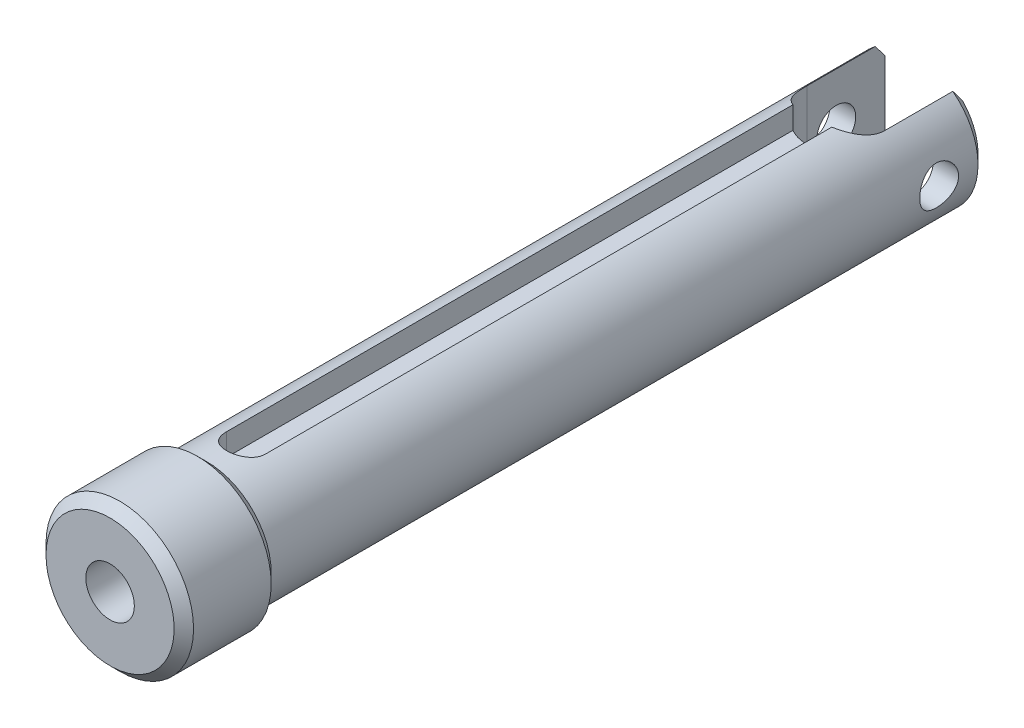
ISO-10303-21;
HEADER;
FILE_DESCRIPTION(('STEP AP214'),'2;1');
FILE_NAME('part.step','',(''),(''),'','','');
FILE_SCHEMA(('AUTOMOTIVE_DESIGN { 1 0 10303 214 1 1 1 1 }'));
ENDSEC;
DATA;
#1=APPLICATION_CONTEXT('core data for automotive mechanical design processes');
#2=APPLICATION_PROTOCOL_DEFINITION('international standard','automotive_design',2000,#1);
#3=PRODUCT_CONTEXT('',#1,'mechanical');
#4=PRODUCT('Part','Part','',(#3));
#5=PRODUCT_RELATED_PRODUCT_CATEGORY('part','',(#4));
#6=PRODUCT_DEFINITION_FORMATION('','',#4);
#7=PRODUCT_DEFINITION_CONTEXT('part definition',#1,'design');
#8=PRODUCT_DEFINITION('design','',#6,#7);
#9=PRODUCT_DEFINITION_SHAPE('','',#8);
#10=(LENGTH_UNIT() NAMED_UNIT(*) SI_UNIT(.MILLI.,.METRE.));
#11=(NAMED_UNIT(*) PLANE_ANGLE_UNIT() SI_UNIT($,.RADIAN.));
#12=(NAMED_UNIT(*) SI_UNIT($,.STERADIAN.) SOLID_ANGLE_UNIT());
#13=UNCERTAINTY_MEASURE_WITH_UNIT(LENGTH_MEASURE(1.E-05),#10,'distance_accuracy_value','');
#14=(GEOMETRIC_REPRESENTATION_CONTEXT(3) GLOBAL_UNCERTAINTY_ASSIGNED_CONTEXT((#13)) GLOBAL_UNIT_ASSIGNED_CONTEXT((#10,
#11,#12)) REPRESENTATION_CONTEXT('',''));
#15=CARTESIAN_POINT('',(0.,0.,0.));
#16=DIRECTION('',(0.,0.,1.));
#17=DIRECTION('',(1.,0.,0.));
#18=AXIS2_PLACEMENT_3D('',#15,#16,#17);
#19=CARTESIAN_POINT('',(0.,0.,-31.0000000000002));
#20=DIRECTION('',(0.,0.,1.));
#21=DIRECTION('',(0.,-1.,0.));
#22=AXIS2_PLACEMENT_3D('',#19,#20,#21);
#23=CONICAL_SURFACE('',#22,1.2499999999993,0.942477796076442);
#24=CARTESIAN_POINT('',(-2.22044604925031E-13,0.,-31.9081781600068));
#25=VERTEX_POINT('',#24);
#26=VERTEX_LOOP('',#25);
#27=FACE_BOUND('',#26,.T.);
#28=CARTESIAN_POINT('',(0.,0.,-31.));
#29=DIRECTION('',(0.,0.,1.));
#30=DIRECTION('',(1.,0.,0.));
#31=AXIS2_PLACEMENT_3D('',#28,#29,#30);
#32=CIRCLE('',#31,1.25);
#33=CARTESIAN_POINT('',(1.25,0.,-31.));
#34=VERTEX_POINT('',#33);
#35=EDGE_CURVE('E276',#34,#34,#32,.T.);
#36=ORIENTED_EDGE('',*,*,#35,.T.);
#37=EDGE_LOOP('',(#36));
#38=FACE_BOUND('',#37,.T.);
#39=ADVANCED_FACE('F39',(#27,#38),#23,.F.);
#40=CARTESIAN_POINT('',(0.,0.,0.));
#41=DIRECTION('',(0.,0.,1.));
#42=DIRECTION('',(1.,0.,0.));
#43=AXIS2_PLACEMENT_3D('',#40,#41,#42);
#44=CYLINDRICAL_SURFACE('',#43,1.25);
#45=CARTESIAN_POINT('',(0.,0.,0.));
#46=DIRECTION('',(0.,0.,1.));
#47=DIRECTION('',(1.,0.,0.));
#48=AXIS2_PLACEMENT_3D('',#45,#46,#47);
#49=CIRCLE('',#48,1.25);
#50=CARTESIAN_POINT('',(1.25,0.,0.));
#51=VERTEX_POINT('',#50);
#52=EDGE_CURVE('E272',#51,#51,#49,.F.);
#53=ORIENTED_EDGE('',*,*,#52,.F.);
#54=EDGE_LOOP('',(#53));
#55=FACE_BOUND('',#54,.T.);
#56=ORIENTED_EDGE('',*,*,#35,.F.);
#57=EDGE_LOOP('',(#56));
#58=FACE_BOUND('',#57,.T.);
#59=ADVANCED_FACE('F349',(#55,#58),#44,.F.);
#60=CARTESIAN_POINT('',(1.25,0.,0.));
#61=DIRECTION('',(0.,0.,1.));
#62=DIRECTION('',(1.,0.,0.));
#63=AXIS2_PLACEMENT_3D('',#60,#61,#62);
#64=PLANE('',#63);
#65=ORIENTED_EDGE('',*,*,#52,.T.);
#66=EDGE_LOOP('',(#65));
#67=FACE_BOUND('',#66,.T.);
#68=CARTESIAN_POINT('',(0.,0.,0.));
#69=DIRECTION('',(0.,0.,-1.));
#70=DIRECTION('',(-1.,0.,0.));
#71=AXIS2_PLACEMENT_3D('',#68,#69,#70);
#72=CIRCLE('',#71,3.30000000002428);
#73=CARTESIAN_POINT('',(-3.30000000002428,0.,0.));
#74=VERTEX_POINT('',#73);
#75=EDGE_CURVE('E268',#74,#74,#72,.T.);
#76=ORIENTED_EDGE('',*,*,#75,.F.);
#77=EDGE_LOOP('',(#76));
#78=FACE_BOUND('',#77,.T.);
#79=ADVANCED_FACE('F343',(#67,#78),#64,.T.);
#80=CARTESIAN_POINT('',(0.,0.,-0.50000000004502));
#81=DIRECTION('',(0.,0.,-1.));
#82=DIRECTION('',(-1.,0.,0.));
#83=AXIS2_PLACEMENT_3D('',#80,#81,#82);
#84=CONICAL_SURFACE('',#83,3.80000000012615,0.785398163454292);
#85=ORIENTED_EDGE('',*,*,#75,.T.);
#86=EDGE_LOOP('',(#85));
#87=FACE_BOUND('',#86,.T.);
#88=CARTESIAN_POINT('',(0.,0.,-0.500000000000001));
#89=DIRECTION('',(0.,0.,1.));
#90=DIRECTION('',(1.,0.,0.));
#91=AXIS2_PLACEMENT_3D('',#88,#89,#90);
#92=CIRCLE('',#91,3.8);
#93=CARTESIAN_POINT('',(3.8,0.,-0.500000000000001));
#94=VERTEX_POINT('',#93);
#95=EDGE_CURVE('E176',#94,#94,#92,.F.);
#96=ORIENTED_EDGE('',*,*,#95,.F.);
#97=EDGE_LOOP('',(#96));
#98=FACE_BOUND('',#97,.T.);
#99=ADVANCED_FACE('F336',(#87,#98),#84,.T.);
#100=CARTESIAN_POINT('',(0.,2.,-7.));
#101=DIRECTION('',(0.,1.,0.));
#102=DIRECTION('',(0.,0.,1.));
#103=AXIS2_PLACEMENT_3D('',#100,#101,#102);
#104=PLANE('',#103);
#105=DIRECTION('',(0.,0.,1.));
#106=VECTOR('',#105,1.);
#107=CARTESIAN_POINT('',(1.,2.,-7.));
#108=LINE('',#107,#106);
#109=CARTESIAN_POINT('',(1.,2.,-36.1761273524378));
#110=VERTEX_POINT('',#109);
#111=CARTESIAN_POINT('',(1.,2.,-7.));
#112=VERTEX_POINT('',#111);
#113=EDGE_CURVE('E141',#110,#112,#108,.T.);
#114=ORIENTED_EDGE('',*,*,#113,.F.);
#115=CARTESIAN_POINT('',(0.,2.,-37.9081781600067));
#116=DIRECTION('',(0.,1.,0.));
#117=DIRECTION('',(0.,0.,1.));
#118=AXIS2_PLACEMENT_3D('',#115,#116,#117);
#119=CIRCLE('',#118,2.);
#120=CARTESIAN_POINT('',(-1.,2.,-36.1761273524378));
#121=VERTEX_POINT('',#120);
#122=EDGE_CURVE('E181',#110,#121,#119,.F.);
#123=ORIENTED_EDGE('',*,*,#122,.T.);
#124=DIRECTION('',(0.,0.,-1.));
#125=VECTOR('',#124,1.);
#126=CARTESIAN_POINT('',(-1.,2.,-7.));
#127=LINE('',#126,#125);
#128=CARTESIAN_POINT('',(-1.,2.,-7.));
#129=VERTEX_POINT('',#128);
#130=EDGE_CURVE('E169',#129,#121,#127,.T.);
#131=ORIENTED_EDGE('',*,*,#130,.F.);
#132=CARTESIAN_POINT('',(0.,2.,-7.));
#133=DIRECTION('',(0.,-1.,0.));
#134=DIRECTION('',(0.,0.,-1.));
#135=AXIS2_PLACEMENT_3D('',#132,#133,#134);
#136=CIRCLE('',#135,1.);
#137=EDGE_CURVE('E144',#129,#112,#136,.F.);
#138=ORIENTED_EDGE('',*,*,#137,.T.);
#139=EDGE_LOOP('',(#114,#123,#131,#138));
#140=FACE_BOUND('',#139,.T.);
#141=ADVANCED_FACE('F333',(#140),#104,.T.);
#142=CARTESIAN_POINT('',(3.3,0.,-41.9081781600067));
#143=DIRECTION('',(0.,0.,-1.));
#144=DIRECTION('',(-1.,0.,0.));
#145=AXIS2_PLACEMENT_3D('',#142,#143,#144);
#146=PLANE('',#145);
#147=DIRECTION('',(0.,1.,0.));
#148=VECTOR('',#147,1.);
#149=CARTESIAN_POINT('',(-2.,-3.8,-41.9081781600067));
#150=LINE('',#149,#148);
#151=CARTESIAN_POINT('',(-2.,1.9595917941417,-41.9081781599484));
#152=VERTEX_POINT('',#151);
#153=CARTESIAN_POINT('',(-2.,-1.95959179408702,-41.9081781599867));
#154=VERTEX_POINT('',#153);
#155=EDGE_CURVE('E281',#152,#154,#150,.F.);
#156=ORIENTED_EDGE('',*,*,#155,.T.);
#157=CARTESIAN_POINT('',(0.,0.,-41.9081781599666));
#158=DIRECTION('',(0.,0.,1.));
#159=DIRECTION('',(1.,0.,0.));
#160=AXIS2_PLACEMENT_3D('',#157,#158,#159);
#161=CIRCLE('',#160,2.79999999992242);
#162=EDGE_CURVE('E179',#152,#154,#161,.T.);
#163=ORIENTED_EDGE('',*,*,#162,.F.);
#164=EDGE_LOOP('',(#156,#163));
#165=FACE_BOUND('',#164,.T.);
#166=ADVANCED_FACE('F335',(#165),#146,.T.);
#167=CARTESIAN_POINT('',(3.3,0.,-41.9081781600067));
#168=DIRECTION('',(0.,0.,-1.));
#169=DIRECTION('',(-1.,0.,0.));
#170=AXIS2_PLACEMENT_3D('',#167,#168,#169);
#171=PLANE('',#170);
#172=DIRECTION('',(0.,1.,0.));
#173=VECTOR('',#172,1.);
#174=CARTESIAN_POINT('',(2.,-3.8,-41.9081781600067));
#175=LINE('',#174,#173);
#176=CARTESIAN_POINT('',(2.,-1.95959179408703,-41.9081781599867));
#177=VERTEX_POINT('',#176);
#178=CARTESIAN_POINT('',(2.,1.95959179408703,-41.9081781599867));
#179=VERTEX_POINT('',#178);
#180=EDGE_CURVE('E263',#177,#179,#175,.T.);
#181=ORIENTED_EDGE('',*,*,#180,.T.);
#182=CARTESIAN_POINT('',(0.,0.,-41.9081781599666));
#183=DIRECTION('',(0.,0.,1.));
#184=DIRECTION('',(1.,0.,0.));
#185=AXIS2_PLACEMENT_3D('',#182,#183,#184);
#186=CIRCLE('',#185,2.79999999992242);
#187=EDGE_CURVE('E319',#177,#179,#186,.T.);
#188=ORIENTED_EDGE('',*,*,#187,.F.);
#189=EDGE_LOOP('',(#181,#188));
#190=FACE_BOUND('',#189,.T.);
#191=ADVANCED_FACE('F41',(#190),#171,.T.);
#192=CARTESIAN_POINT('',(0.,0.,0.));
#193=DIRECTION('',(0.,0.,1.));
#194=DIRECTION('',(1.,0.,0.));
#195=AXIS2_PLACEMENT_3D('',#192,#193,#194);
#196=CYLINDRICAL_SURFACE('',#195,3.8);
#197=CARTESIAN_POINT('',(0.,0.,-4.50000000000728));
#198=DIRECTION('',(0.,0.,1.));
#199=DIRECTION('',(1.,0.,0.));
#200=AXIS2_PLACEMENT_3D('',#197,#198,#199);
#201=CIRCLE('',#200,3.80000000001246);
#202=CARTESIAN_POINT('',(3.80000000001246,0.,-4.50000000000728));
#203=VERTEX_POINT('',#202);
#204=EDGE_CURVE('E171',#203,#203,#201,.F.);
#205=ORIENTED_EDGE('',*,*,#204,.F.);
#206=EDGE_LOOP('',(#205));
#207=FACE_BOUND('',#206,.T.);
#208=ORIENTED_EDGE('',*,*,#95,.T.);
#209=EDGE_LOOP('',(#208));
#210=FACE_BOUND('',#209,.T.);
#211=ADVANCED_FACE('F346',(#207,#210),#196,.T.);
#212=CARTESIAN_POINT('',(1.,12.,-7.));
#213=DIRECTION('',(-1.,0.,0.));
#214=DIRECTION('',(0.,0.,1.));
#215=AXIS2_PLACEMENT_3D('',#212,#213,#214);
#216=PLANE('',#215);
#217=DIRECTION('',(0.,-1.,0.));
#218=VECTOR('',#217,1.);
#219=CARTESIAN_POINT('',(1.,12.,-7.));
#220=LINE('',#219,#218);
#221=CARTESIAN_POINT('',(1.,3.14483703870328,-7.));
#222=VERTEX_POINT('',#221);
#223=EDGE_CURVE('E133',#112,#222,#220,.F.);
#224=ORIENTED_EDGE('',*,*,#223,.T.);
#225=DIRECTION('',(0.,0.,1.));
#226=VECTOR('',#225,1.);
#227=CARTESIAN_POINT('',(0.999999999999997,3.14483703870328,0.));
#228=LINE('',#227,#226);
#229=CARTESIAN_POINT('',(1.,3.14483703870328,-36.1761273524378));
#230=VERTEX_POINT('',#229);
#231=EDGE_CURVE('E138',#230,#222,#228,.T.);
#232=ORIENTED_EDGE('',*,*,#231,.F.);
#233=DIRECTION('',(0.,1.,0.));
#234=VECTOR('',#233,1.);
#235=CARTESIAN_POINT('',(1.,-3.8,-36.1761273524378));
#236=LINE('',#235,#234);
#237=EDGE_CURVE('E264',#230,#110,#236,.F.);
#238=ORIENTED_EDGE('',*,*,#237,.T.);
#239=ORIENTED_EDGE('',*,*,#113,.T.);
#240=EDGE_LOOP('',(#224,#232,#238,#239));
#241=FACE_BOUND('',#240,.T.);
#242=ADVANCED_FACE('F135',(#241),#216,.T.);
#243=CARTESIAN_POINT('',(0.,12.,-7.));
#244=DIRECTION('',(0.,-1.,0.));
#245=DIRECTION('',(0.,0.,-1.));
#246=AXIS2_PLACEMENT_3D('',#243,#244,#245);
#247=CYLINDRICAL_SURFACE('',#246,1.);
#248=ORIENTED_EDGE('',*,*,#137,.F.);
#249=DIRECTION('',(0.,1.,0.));
#250=VECTOR('',#249,1.);
#251=CARTESIAN_POINT('',(-1.,12.,-7.));
#252=LINE('',#251,#250);
#253=CARTESIAN_POINT('',(-1.,3.14483703870327,-7.));
#254=VERTEX_POINT('',#253);
#255=EDGE_CURVE('E143',#254,#129,#252,.F.);
#256=ORIENTED_EDGE('',*,*,#255,.F.);
#257=CARTESIAN_POINT('',(1.,3.14483703870327,-7.));
#258=CARTESIAN_POINT('',(1.00000058446485,3.14483466319056,-6.97256109089109));
#259=CARTESIAN_POINT('',(0.998869935383343,3.14519660366548,-6.94513601880278));
#260=CARTESIAN_POINT('',(0.994364372490053,3.14662483342331,-6.89049551172468));
#261=CARTESIAN_POINT('',(0.990989971874482,3.14769096164235,-6.8632800302364));
#262=CARTESIAN_POINT('',(0.977558579012706,3.15189978520597,-6.78238818203788));
#263=CARTESIAN_POINT('',(0.964193099721557,3.1560532526192,-6.72927493985201));
#264=CARTESIAN_POINT('',(0.929101879648924,3.16655966647781,-6.62618327140285));
#265=CARTESIAN_POINT('',(0.907379209601419,3.17291180496607,-6.57620370155038));
#266=CARTESIAN_POINT('',(0.856227318830381,3.18709542858823,-6.48056143224296));
#267=CARTESIAN_POINT('',(0.82679441203035,3.19492762079944,-6.43490081182208));
#268=CARTESIAN_POINT('',(0.760050107473455,3.21146959337391,-6.34775495832486));
#269=CARTESIAN_POINT('',(0.722534508354982,3.22019826968664,-6.30642974127771));
#270=CARTESIAN_POINT('',(0.641124678022101,3.237389021534,-6.23054817290801));
#271=CARTESIAN_POINT('',(0.597229366735894,3.24585105163024,-6.19599297006512));
#272=CARTESIAN_POINT('',(0.503159555901947,3.26177102246715,-6.13393351088603));
#273=CARTESIAN_POINT('',(0.452871926360489,3.26920395361822,-6.10659376340788));
#274=CARTESIAN_POINT('',(0.348151281826175,3.28200676071688,-6.06082286305101));
#275=CARTESIAN_POINT('',(0.29371935706494,3.28737717701464,-6.04238937652894));
#276=CARTESIAN_POINT('',(0.183936750095662,3.29531583832292,-6.01548615853358));
#277=CARTESIAN_POINT('',(0.128659057368611,3.29796117629446,-6.00674174325955));
#278=CARTESIAN_POINT('',(0.0173609280514114,3.30042333545331,-5.998595838082));
#279=CARTESIAN_POINT('',(-0.0386593626860392,3.30024070408913,-5.99919253989158));
#280=CARTESIAN_POINT('',(-0.147921762483602,3.29712168803216,-6.00952880677701));
#281=CARTESIAN_POINT('',(-0.201194998209486,3.29427497016586,-6.0189706750913));
#282=CARTESIAN_POINT('',(-0.305361228362162,3.28625698323866,-6.04624231094544));
#283=CARTESIAN_POINT('',(-0.356254097082038,3.28108559156468,-6.06407252092406));
#284=CARTESIAN_POINT('',(-0.45491871979671,3.26887616846965,-6.10781394900735));
#285=CARTESIAN_POINT('',(-0.502646534164445,3.26181682101702,-6.13381808312765));
#286=CARTESIAN_POINT('',(-0.59315506276725,3.24657920737532,-6.19309529006151));
#287=CARTESIAN_POINT('',(-0.635934643024798,3.23840068564096,-6.22637002403718));
#288=CARTESIAN_POINT('',(-0.717105293590922,3.22142018042105,-6.30077988504639));
#289=CARTESIAN_POINT('',(-0.755258554122722,3.2126063247781,-6.34217203761805));
#290=CARTESIAN_POINT('',(-0.824157753357584,3.19562620313545,-6.43086254822946));
#291=CARTESIAN_POINT('',(-0.854901515300654,3.18746012791199,-6.47816263571923));
#292=CARTESIAN_POINT('',(-0.908367901499331,3.17264058733765,-6.57797226116264));
#293=CARTESIAN_POINT('',(-0.931003162469822,3.16600385648028,-6.63053116273699));
#294=CARTESIAN_POINT('',(-0.96700287373763,3.15519643045607,-6.73893484407036));
#295=CARTESIAN_POINT('',(-0.980381536827423,3.15102195614449,-6.79477444289047));
#296=CARTESIAN_POINT('',(-0.992589206484928,3.14718577754826,-6.87594846249085));
#297=CARTESIAN_POINT('',(-0.995367858450242,3.14630699315726,-6.90068681113467));
#298=CARTESIAN_POINT('',(-0.999071633157644,3.14513251759889,-6.95027923689093));
#299=CARTESIAN_POINT('',(-0.999999456846607,3.14483597676302,-6.97513309223449));
#300=CARTESIAN_POINT('',(-1.,3.14483703870327,-7.));
#301=B_SPLINE_CURVE_WITH_KNOTS('',3,(#257,#258,#259,#260,#261,#262,#263,#264,#265,#266,#267,
#268,#269,#270,#271,#272,#273,#274,#275,#276,#277,#278,#279,#280,#281,#282,#283,#284,#285,#286,
#287,#288,#289,#290,#291,#292,#293,#294,#295,#296,#297,#298,#299,#300),.UNSPECIFIED.,.F.,.F.,(4,
2,2,2,2,2,2,2,2,2,2,2,2,2,2,2,2,2,2,2,2,4),(0.,0.0822639668022753,0.164509124462838,
0.328432621976645,0.492295945508559,0.656237751530239,0.824946577892225,0.993683999644774,
1.16598871173084,1.33824825153758,1.50548829210002,1.6726959581369,1.83447076928378,
1.99625411411647,2.15994740632491,2.3236781378043,2.49382803113785,2.66402785028373,
2.83600989360371,3.0077272822234,3.08239220960877,3.15694809718305),.UNSPECIFIED.);
#302=EDGE_CURVE('E147',#222,#254,#301,.T.);
#303=ORIENTED_EDGE('',*,*,#302,.F.);
#304=ORIENTED_EDGE('',*,*,#223,.F.);
#305=EDGE_LOOP('',(#248,#256,#303,#304));
#306=FACE_BOUND('',#305,.T.);
#307=ADVANCED_FACE('F148',(#306),#247,.F.);
#308=CARTESIAN_POINT('',(-1.,12.,-7.));
#309=DIRECTION('',(1.,0.,0.));
#310=DIRECTION('',(0.,0.,-1.));
#311=AXIS2_PLACEMENT_3D('',#308,#309,#310);
#312=PLANE('',#311);
#313=ORIENTED_EDGE('',*,*,#255,.T.);
#314=ORIENTED_EDGE('',*,*,#130,.T.);
#315=DIRECTION('',(0.,1.,0.));
#316=VECTOR('',#315,1.);
#317=CARTESIAN_POINT('',(-1.,-3.8,-36.1761273524378));
#318=LINE('',#317,#316);
#319=CARTESIAN_POINT('',(-0.999999999999997,3.14483703870327,-36.1761273524378));
#320=VERTEX_POINT('',#319);
#321=EDGE_CURVE('E227',#121,#320,#318,.T.);
#322=ORIENTED_EDGE('',*,*,#321,.T.);
#323=DIRECTION('',(0.,0.,1.));
#324=VECTOR('',#323,1.);
#325=CARTESIAN_POINT('',(-1.,3.14483703870327,0.));
#326=LINE('',#325,#324);
#327=EDGE_CURVE('E153',#254,#320,#326,.F.);
#328=ORIENTED_EDGE('',*,*,#327,.F.);
#329=EDGE_LOOP('',(#313,#314,#322,#328));
#330=FACE_BOUND('',#329,.T.);
#331=ADVANCED_FACE('F302',(#330),#312,.T.);
#332=CARTESIAN_POINT('',(0.,0.,-41.4081781600353));
#333=DIRECTION('',(0.,0.,1.));
#334=DIRECTION('',(1.,0.,0.));
#335=AXIS2_PLACEMENT_3D('',#332,#333,#334);
#336=CONICAL_SURFACE('',#335,3.29999999985375,0.785398163397448);
#337=CARTESIAN_POINT('',(-2.00000000002675,2.62488094963453,-41.4081781599479));
#338=CARTESIAN_POINT('',(-2.00000000000966,2.5705897477742,-41.4513571675065));
#339=CARTESIAN_POINT('',(-2.0000000000026,2.51606255803639,-41.4942421574162));
#340=CARTESIAN_POINT('',(-1.9999999999974,2.40647248083344,-41.5792952953835));
#341=CARTESIAN_POINT('',(-1.99999999999926,2.35140971987974,-41.6214636065639));
#342=CARTESIAN_POINT('',(-2.00000000000074,2.24065670022885,-41.7049769497188));
#343=CARTESIAN_POINT('',(-2.00000000000037,2.18496640664413,-41.7463219355635));
#344=CARTESIAN_POINT('',(-1.99999999999963,2.07285129425181,-41.8280303119863));
#345=CARTESIAN_POINT('',(-1.99999999999926,2.01642630858367,-41.8683934733883));
#346=CARTESIAN_POINT('',(-2.,1.95959179416729,-41.9081781599305));
#347=B_SPLINE_CURVE_WITH_KNOTS('',3,(#337,#338,#339,#340,#341,#342,#343,#344,#345,#346),
.UNSPECIFIED.,.F.,.F.,(4,2,2,2,4),(0.,0.208106269114682,0.416164519243032,0.624234393958115,
0.832352378876906),.UNSPECIFIED.);
#348=CARTESIAN_POINT('',(-2.,2.62488094965267,-41.4081781599707));
#349=VERTEX_POINT('',#348);
#350=EDGE_CURVE('E283',#349,#152,#347,.T.);
#351=ORIENTED_EDGE('',*,*,#350,.T.);
#352=ORIENTED_EDGE('',*,*,#162,.T.);
#353=CARTESIAN_POINT('',(-2.00000000001522,-1.95959179417273,-41.9081781599373));
#354=CARTESIAN_POINT('',(-2.0000000000055,-2.01642630858618,-41.8683934733909));
#355=CARTESIAN_POINT('',(-2.00000000000148,-2.07285129425285,-41.8280303119869));
#356=CARTESIAN_POINT('',(-1.99999999999852,-2.1849664066439,-41.7463219355623));
#357=CARTESIAN_POINT('',(-1.99999999999958,-2.24065670022884,-41.7049769497179));
#358=CARTESIAN_POINT('',(-2.00000000000042,-2.35140971988068,-41.6214636065641));
#359=CARTESIAN_POINT('',(-2.00000000000021,-2.40647248083511,-41.5792952953845));
#360=CARTESIAN_POINT('',(-1.99999999999979,-2.51606255803605,-41.4942421574142));
#361=CARTESIAN_POINT('',(-1.99999999999958,-2.57058974777112,-41.4513571675009));
#362=CARTESIAN_POINT('',(-2.,-2.62488094962501,-41.4081781599338));
#363=B_SPLINE_CURVE_WITH_KNOTS('',3,(#353,#354,#355,#356,#357,#358,#359,#360,#361,#362),
.UNSPECIFIED.,.F.,.F.,(4,2,2,2,4),(0.,0.20811798491885,0.41618785963396,0.624246109762607,
0.832352378877637),.UNSPECIFIED.);
#364=CARTESIAN_POINT('',(-1.99999999999991,-2.62488094965283,-41.4081781599706));
#365=VERTEX_POINT('',#364);
#366=EDGE_CURVE('E104',#154,#365,#363,.T.);
#367=ORIENTED_EDGE('',*,*,#366,.T.);
#368=CARTESIAN_POINT('',(0.,0.,-41.4081781600067));
#369=DIRECTION('',(0.,0.,1.));
#370=DIRECTION('',(1.,0.,0.));
#371=AXIS2_PLACEMENT_3D('',#368,#369,#370);
#372=CIRCLE('',#371,3.3);
#373=EDGE_CURVE('E323',#349,#365,#372,.T.);
#374=ORIENTED_EDGE('',*,*,#373,.F.);
#375=EDGE_LOOP('',(#351,#352,#367,#374));
#376=FACE_BOUND('',#375,.T.);
#377=ADVANCED_FACE('F299',(#376),#336,.T.);
#378=CARTESIAN_POINT('',(-2.,-3.8,-41.9081781600067));
#379=DIRECTION('',(-1.,0.,0.));
#380=DIRECTION('',(0.,0.,1.));
#381=AXIS2_PLACEMENT_3D('',#378,#379,#380);
#382=PLANE('',#381);
#383=ORIENTED_EDGE('',*,*,#366,.F.);
#384=ORIENTED_EDGE('',*,*,#155,.F.);
#385=ORIENTED_EDGE('',*,*,#350,.F.);
#386=DIRECTION('',(0.,0.,1.));
#387=VECTOR('',#386,1.);
#388=CARTESIAN_POINT('',(-2.,2.62488094968134,-4.));
#389=LINE('',#388,#387);
#390=CARTESIAN_POINT('',(-2.,2.62488094968133,-37.9081781600067));
#391=VERTEX_POINT('',#390);
#392=EDGE_CURVE('E226',#391,#349,#389,.F.);
#393=ORIENTED_EDGE('',*,*,#392,.F.);
#394=DIRECTION('',(0.,1.,0.));
#395=VECTOR('',#394,1.);
#396=CARTESIAN_POINT('',(-2.,-3.8,-37.9081781600067));
#397=LINE('',#396,#395);
#398=CARTESIAN_POINT('',(-1.99999999999995,-2.6248809496814,-37.9081781600067));
#399=VERTEX_POINT('',#398);
#400=EDGE_CURVE('E96',#391,#399,#397,.F.);
#401=ORIENTED_EDGE('',*,*,#400,.T.);
#402=DIRECTION('',(0.,0.,1.));
#403=VECTOR('',#402,1.);
#404=CARTESIAN_POINT('',(-1.99999999999982,-2.62488094968147,-4.));
#405=LINE('',#404,#403);
#406=EDGE_CURVE('E325',#365,#399,#405,.T.);
#407=ORIENTED_EDGE('',*,*,#406,.F.);
#408=EDGE_LOOP('',(#383,#384,#385,#393,#401,#407));
#409=FACE_BOUND('',#408,.T.);
#410=CARTESIAN_POINT('',(-2.,0.,-39.4081781600067));
#411=DIRECTION('',(1.,0.,0.));
#412=DIRECTION('',(0.,0.,-1.));
#413=AXIS2_PLACEMENT_3D('',#410,#411,#412);
#414=CIRCLE('',#413,1.);
#415=CARTESIAN_POINT('',(-2.,0.,-40.4081781600067));
#416=VERTEX_POINT('',#415);
#417=EDGE_CURVE('E326',#416,#416,#414,.F.);
#418=ORIENTED_EDGE('',*,*,#417,.T.);
#419=EDGE_LOOP('',(#418));
#420=FACE_BOUND('',#419,.T.);
#421=ADVANCED_FACE('F235',(#409,#420),#382,.F.);
#422=CARTESIAN_POINT('',(0.,-3.8,-37.9081781600067));
#423=DIRECTION('',(0.,1.,0.));
#424=DIRECTION('',(0.,0.,1.));
#425=AXIS2_PLACEMENT_3D('',#422,#423,#424);
#426=CYLINDRICAL_SURFACE('',#425,2.);
#427=DIRECTION('',(0.,1.,0.));
#428=VECTOR('',#427,1.);
#429=CARTESIAN_POINT('',(2.,-3.8,-37.9081781600067));
#430=LINE('',#429,#428);
#431=CARTESIAN_POINT('',(1.99999999999995,2.62488094968141,-37.9081781600067));
#432=VERTEX_POINT('',#431);
#433=CARTESIAN_POINT('',(2.,-2.62488094968134,-37.9081781600067));
#434=VERTEX_POINT('',#433);
#435=EDGE_CURVE('E262',#432,#434,#430,.F.);
#436=ORIENTED_EDGE('',*,*,#435,.T.);
#437=CARTESIAN_POINT('',(-1.99999999999995,-2.6248809496814,-37.9081781600067));
#438=CARTESIAN_POINT('',(-2.00001141375189,-2.62485908553081,-37.8577182015219));
#439=CARTESIAN_POINT('',(-1.99809081784711,-2.62633541507722,-37.8072711459366));
#440=CARTESIAN_POINT('',(-1.99047647439558,-2.63211786689629,-37.7068750114857));
#441=CARTESIAN_POINT('',(-1.98478651030481,-2.6364211516121,-37.6569254842093));
#442=CARTESIAN_POINT('',(-1.96978541481428,-2.64764555735113,-37.5582977351015));
#443=CARTESIAN_POINT('',(-1.96050420662925,-2.65454503346351,-37.509612465875));
#444=CARTESIAN_POINT('',(-1.93846979379115,-2.67067813108733,-37.413434419947));
#445=CARTESIAN_POINT('',(-1.92571586804804,-2.67991223734294,-37.3659418931511));
#446=CARTESIAN_POINT('',(-1.88259955485896,-2.7105463431874,-37.2260478731256));
#447=CARTESIAN_POINT('',(-1.84731050027589,-2.73493575869182,-37.1357698172825));
#448=CARTESIAN_POINT('',(-1.76484721587145,-2.78885973063445,-36.9623557833843));
#449=CARTESIAN_POINT('',(-1.71764543433784,-2.81840616466552,-36.8792369692841));
#450=CARTESIAN_POINT('',(-1.60588803130708,-2.8837145909214,-36.711302083677));
#451=CARTESIAN_POINT('',(-1.5399055796643,-2.91979286229894,-36.6275560314083));
#452=CARTESIAN_POINT('',(-1.39540548854133,-2.99154784329577,-36.471458032231));
#453=CARTESIAN_POINT('',(-1.31688329455569,-3.02722440195131,-36.3991102442758));
#454=CARTESIAN_POINT('',(-1.13893247148711,-3.09887290109035,-36.2598566737604));
#455=CARTESIAN_POINT('',(-1.03815015758804,-3.13443686251461,-36.194449721882));
#456=CARTESIAN_POINT('',(-0.824440339959093,-3.19728934054272,-36.0820257097373));
#457=CARTESIAN_POINT('',(-0.711523589687234,-3.22458510376281,-36.0349925353403));
#458=CARTESIAN_POINT('',(-0.488319582965326,-3.26544644578842,-35.965539031417));
#459=CARTESIAN_POINT('',(-0.37883932533531,-3.28008686297259,-35.9411740916202));
#460=CARTESIAN_POINT('',(-0.156468714292664,-3.29816863398907,-35.911163388395));
#461=CARTESIAN_POINT('',(-0.0435817510514555,-3.30162077350502,-35.9054995966533));
#462=CARTESIAN_POINT('',(0.166993639566343,-3.29723986947803,-35.9127365359855));
#463=CARTESIAN_POINT('',(0.264799067567271,-3.29077851151816,-35.9233805546774));
#464=CARTESIAN_POINT('',(0.456928212472948,-3.26964142423436,-35.9586257893767));
#465=CARTESIAN_POINT('',(0.551251679884337,-3.25496510749607,-35.983228003473));
#466=CARTESIAN_POINT('',(0.734569673337691,-3.21857054115832,-36.0454293070239));
#467=CARTESIAN_POINT('',(0.823534664668707,-3.19681686490068,-36.0830938455951));
#468=CARTESIAN_POINT('',(0.993978644033839,-3.1479956130385,-36.1700272342612));
#469=CARTESIAN_POINT('',(1.07545599419037,-3.12092687883873,-36.2192986149254));
#470=CARTESIAN_POINT('',(1.23915041762318,-3.05990599608629,-36.334738361296));
#471=CARTESIAN_POINT('',(1.32027211560713,-3.02551741362733,-36.4022277633862));
#472=CARTESIAN_POINT('',(1.47075995843933,-2.95529691304858,-36.5487943664951));
#473=CARTESIAN_POINT('',(1.54010628317793,-2.91946268465201,-36.6278906951041));
#474=CARTESIAN_POINT('',(1.6734805918589,-2.84533841934474,-36.8066553937573));
#475=CARTESIAN_POINT('',(1.73586657514684,-2.80727115763698,-36.9076537940503));
#476=CARTESIAN_POINT('',(1.84235403929794,-2.73856846366553,-37.12087209915));
#477=CARTESIAN_POINT('',(1.8865203002211,-2.70790686473237,-37.2330504554331));
#478=CARTESIAN_POINT('',(1.9463414145767,-2.6651051723386,-37.4387552462391));
#479=CARTESIAN_POINT('',(1.96625788671106,-2.65030553639532,-37.5304675474341));
#480=CARTESIAN_POINT('',(1.98639393074554,-2.63520502478979,-37.6704961122088));
#481=CARTESIAN_POINT('',(1.99148339192867,-2.63135371853699,-37.7177722265152));
#482=CARTESIAN_POINT('',(1.99829089089583,-2.62618383738281,-37.8127499068531));
#483=CARTESIAN_POINT('',(2.00000559557829,-2.62486776645129,-37.8604518468044));
#484=CARTESIAN_POINT('',(2.,-2.62488094968134,-37.9081781600067));
#485=B_SPLINE_CURVE_WITH_KNOTS('',3,(#437,#438,#439,#440,#441,#442,#443,#444,#445,#446,#447,
#448,#449,#450,#451,#452,#453,#454,#455,#456,#457,#458,#459,#460,#461,#462,#463,#464,#465,#466,
#467,#468,#469,#470,#471,#472,#473,#474,#475,#476,#477,#478,#479,#480,#481,#482,#483,#484),
.UNSPECIFIED.,.F.,.F.,(4,2,2,2,2,2,2,2,2,2,2,2,2,2,2,2,2,2,2,2,2,2,2,4),(0.,0.151300853332439,
0.302450069971211,0.452366087262481,0.602313257532468,0.900817591405965,1.20001873505573,
1.53635946007346,1.87282262495245,2.24668591955917,2.62022058931272,2.95752964390851,
3.29451343015714,3.58888974232006,3.8832871066849,4.17918139273937,4.47514025063153,
4.80678470393645,5.13898195819916,5.5111216729569,5.88192660093375,6.16556750629642,
6.3085112545017,6.45159611138061),.UNSPECIFIED.);
#486=EDGE_CURVE('E203',#399,#434,#485,.T.);
#487=ORIENTED_EDGE('',*,*,#486,.F.);
#488=ORIENTED_EDGE('',*,*,#400,.F.);
#489=CARTESIAN_POINT('',(-0.999999999999997,3.14483703870327,-36.1761273524378));
#490=CARTESIAN_POINT('',(-1.05113721235326,3.12857913650816,-36.2056569629357));
#491=CARTESIAN_POINT('',(-1.10071844754428,3.11143634329977,-36.2372972660396));
#492=CARTESIAN_POINT('',(-1.1965780285225,3.0758432612108,-36.3045470449479));
#493=CARTESIAN_POINT('',(-1.24285789697496,3.05739358302373,-36.340154671263));
#494=CARTESIAN_POINT('',(-1.37675934616026,3.00065499038584,-36.4527889971314));
#495=CARTESIAN_POINT('',(-1.45917611886038,2.96106541793059,-36.5354717852067));
#496=CARTESIAN_POINT('',(-1.60849878003641,2.88268087144283,-36.7139075831346));
#497=CARTESIAN_POINT('',(-1.67541955478012,2.84388516772295,-36.8096479075244));
#498=CARTESIAN_POINT('',(-1.79222320403543,2.77175849014142,-37.0128543877571));
#499=CARTESIAN_POINT('',(-1.84213328137765,2.73841883599764,-37.1203014559883));
#500=CARTESIAN_POINT('',(-1.91370258237478,2.6887177326132,-37.3196825327594));
#501=CARTESIAN_POINT('',(-1.93918259113978,2.67022710122935,-37.4097173628952));
#502=CARTESIAN_POINT('',(-1.97733534822835,2.64210638861402,-37.593689049103));
#503=CARTESIAN_POINT('',(-1.99004628503943,2.63244989489533,-37.6876133901786));
#504=CARTESIAN_POINT('',(-1.99734698791768,2.62689993433973,-37.8030480588162));
#505=CARTESIAN_POINT('',(-1.99834161092716,2.62614351542956,-37.8240595224112));
#506=CARTESIAN_POINT('',(-1.99966732720865,2.62513485670056,-37.8661043517695));
#507=CARTESIAN_POINT('',(-1.99999877105465,2.62488235050038,-37.887137700077));
#508=CARTESIAN_POINT('',(-2.00000000000001,2.62488094968283,-37.9081781600068));
#509=B_SPLINE_CURVE_WITH_KNOTS('',3,(#489,#490,#491,#492,#493,#494,#495,#496,#497,#498,#499,
#500,#501,#502,#503,#504,#505,#506,#507,#508),.UNSPECIFIED.,.F.,.F.,(4,2,2,2,2,2,2,2,2,4),(0.,
0.183599352240493,0.367113469328094,0.735092664066689,1.102716878417,1.46975041365001,
1.75476183793752,2.03891831745167,2.10205477050367,2.16515783913631),.UNSPECIFIED.);
#510=EDGE_CURVE('E218',#320,#391,#509,.T.);
#511=ORIENTED_EDGE('',*,*,#510,.F.);
#512=ORIENTED_EDGE('',*,*,#321,.F.);
#513=ORIENTED_EDGE('',*,*,#122,.F.);
#514=ORIENTED_EDGE('',*,*,#237,.F.);
#515=CARTESIAN_POINT('',(1.99999999999995,2.62488094968141,-37.9081781600067));
#516=CARTESIAN_POINT('',(2.00001143364726,2.62485906071945,-37.8577059622819));
#517=CARTESIAN_POINT('',(1.99808989554319,2.62633611907257,-37.807246662023));
#518=CARTESIAN_POINT('',(1.99047185330716,2.6321213675917,-37.7068263425899));
#519=CARTESIAN_POINT('',(1.98477913223592,2.63642672051904,-37.6568648749449));
#520=CARTESIAN_POINT('',(1.96977448457558,2.64765369080859,-37.5582379009572));
#521=CARTESIAN_POINT('',(1.96049425855775,2.65455237814493,-37.509564926452));
#522=CARTESIAN_POINT('',(1.93846348436107,2.67068268963989,-37.4134110042224));
#523=CARTESIAN_POINT('',(1.92571222392071,2.67991479259109,-37.365930303341));
#524=CARTESIAN_POINT('',(1.88260867996247,2.71053992729282,-37.2260770147337));
#525=CARTESIAN_POINT('',(1.8473334882408,2.73492021849851,-37.1358267946253));
#526=CARTESIAN_POINT('',(1.76487566784995,2.78884163138274,-36.962406935883));
#527=CARTESIAN_POINT('',(1.71765812546792,2.81839780554633,-36.8792590313838));
#528=CARTESIAN_POINT('',(1.60582714258021,2.88375123344878,-36.7112072223474));
#529=CARTESIAN_POINT('',(1.53977690471309,2.91986678961857,-36.6273832904324));
#530=CARTESIAN_POINT('',(1.39521570001368,2.99163204505648,-36.4712867910875));
#531=CARTESIAN_POINT('',(1.31672778306607,3.02728247656649,-36.398993342757));
#532=CARTESIAN_POINT('',(1.19590096052155,3.07593760689471,-36.3044346838818));
#533=CARTESIAN_POINT('',(1.15813527209333,3.09037606115267,-36.27694653544));
#534=CARTESIAN_POINT('',(1.08057404273195,3.1183420520438,-36.2245673130562));
#535=CARTESIAN_POINT('',(1.04078021018173,3.13187033376978,-36.1996741054192));
#536=CARTESIAN_POINT('',(1.,3.14483703870328,-36.1761273524378));
#537=B_SPLINE_CURVE_WITH_KNOTS('',3,(#515,#516,#517,#518,#519,#520,#521,#522,#523,#524,#525,
#526,#527,#528,#529,#530,#531,#532,#533,#534,#535,#536),.UNSPECIFIED.,.F.,.F.,(4,2,2,2,2,2,2,2,
2,2,4),(0.,0.151337544994695,0.302523505216702,0.452402987902581,0.602313249299563,
0.900724651076737,1.20001875796275,1.53672913548342,1.87282265562085,2.01939429190622,
2.16584444264363),.UNSPECIFIED.);
#538=EDGE_CURVE('E160',#432,#230,#537,.T.);
#539=ORIENTED_EDGE('',*,*,#538,.F.);
#540=EDGE_LOOP('',(#436,#487,#488,#511,#512,#513,#514,#539));
#541=FACE_BOUND('',#540,.T.);
#542=ADVANCED_FACE('F229',(#541),#426,.F.);
#543=CARTESIAN_POINT('',(2.,-3.8,-41.9081781600067));
#544=DIRECTION('',(1.,0.,0.));
#545=DIRECTION('',(0.,0.,-1.));
#546=AXIS2_PLACEMENT_3D('',#543,#544,#545);
#547=PLANE('',#546);
#548=CARTESIAN_POINT('',(2.00000000001522,1.95959179417274,-41.9081781599373));
#549=CARTESIAN_POINT('',(2.0000000000055,2.01642630858619,-41.8683934733909));
#550=CARTESIAN_POINT('',(2.00000000000148,2.07285129425285,-41.8280303119869));
#551=CARTESIAN_POINT('',(1.99999999999852,2.18496640664391,-41.7463219355623));
#552=CARTESIAN_POINT('',(1.99999999999958,2.24065670022885,-41.7049769497179));
#553=CARTESIAN_POINT('',(2.00000000000042,2.35140971988068,-41.6214636065641));
#554=CARTESIAN_POINT('',(2.00000000000021,2.40647248083511,-41.5792952953845));
#555=CARTESIAN_POINT('',(1.99999999999979,2.51606255803606,-41.4942421574142));
#556=CARTESIAN_POINT('',(1.99999999999958,2.57058974777113,-41.4513571675009));
#557=CARTESIAN_POINT('',(2.,2.62488094962501,-41.4081781599338));
#558=B_SPLINE_CURVE_WITH_KNOTS('',3,(#548,#549,#550,#551,#552,#553,#554,#555,#556,#557),
.UNSPECIFIED.,.F.,.F.,(4,2,2,2,4),(0.,0.208117984918853,0.416187859633959,0.624246109762606,
0.832352378877635),.UNSPECIFIED.);
#559=CARTESIAN_POINT('',(1.99999999999991,2.62488094965284,-41.4081781599706));
#560=VERTEX_POINT('',#559);
#561=EDGE_CURVE('E260',#179,#560,#558,.T.);
#562=ORIENTED_EDGE('',*,*,#561,.F.);
#563=ORIENTED_EDGE('',*,*,#180,.F.);
#564=CARTESIAN_POINT('',(2.00000000002659,-2.62488094963395,-41.4081781599482));
#565=CARTESIAN_POINT('',(2.0000000000096,-2.57058974777384,-41.4513571675068));
#566=CARTESIAN_POINT('',(2.00000000000258,-2.51606255803623,-41.4942421574163));
#567=CARTESIAN_POINT('',(1.99999999999742,-2.40647248083367,-41.5792952953834));
#568=CARTESIAN_POINT('',(1.99999999999926,-2.35140971988016,-41.6214636065636));
#569=CARTESIAN_POINT('',(2.00000000000074,-2.24065670022965,-41.7049769497182));
#570=CARTESIAN_POINT('',(2.00000000000037,-2.18496640664512,-41.7463219355627));
#571=CARTESIAN_POINT('',(1.99999999999963,-2.07285129425321,-41.8280303119854));
#572=CARTESIAN_POINT('',(1.99999999999926,-2.01642630858527,-41.8683934733871));
#573=CARTESIAN_POINT('',(2.,-1.95959179416909,-41.9081781599292));
#574=B_SPLINE_CURVE_WITH_KNOTS('',3,(#564,#565,#566,#567,#568,#569,#570,#571,#572,#573),
.UNSPECIFIED.,.F.,.F.,(4,2,2,2,4),(0.,0.208106269113965,0.416164519241599,0.624234393955965,
0.83235237887404),.UNSPECIFIED.);
#575=CARTESIAN_POINT('',(2.,-2.62488094965241,-41.4081781599709));
#576=VERTEX_POINT('',#575);
#577=EDGE_CURVE('E61',#576,#177,#574,.T.);
#578=ORIENTED_EDGE('',*,*,#577,.F.);
#579=DIRECTION('',(0.,0.,1.));
#580=VECTOR('',#579,1.);
#581=CARTESIAN_POINT('',(2.,-2.62488094968134,-4.));
#582=LINE('',#581,#580);
#583=EDGE_CURVE('E253',#434,#576,#582,.F.);
#584=ORIENTED_EDGE('',*,*,#583,.F.);
#585=ORIENTED_EDGE('',*,*,#435,.F.);
#586=DIRECTION('',(0.,0.,1.));
#587=VECTOR('',#586,1.);
#588=CARTESIAN_POINT('',(1.99999999999981,2.62488094968148,-4.));
#589=LINE('',#588,#587);
#590=EDGE_CURVE('E162',#560,#432,#589,.T.);
#591=ORIENTED_EDGE('',*,*,#590,.F.);
#592=EDGE_LOOP('',(#562,#563,#578,#584,#585,#591));
#593=FACE_BOUND('',#592,.T.);
#594=CARTESIAN_POINT('',(2.,0.,-39.4081781600067));
#595=DIRECTION('',(1.,0.,0.));
#596=DIRECTION('',(0.,0.,-1.));
#597=AXIS2_PLACEMENT_3D('',#594,#595,#596);
#598=CIRCLE('',#597,1.);
#599=CARTESIAN_POINT('',(2.,0.,-40.4081781600067));
#600=VERTEX_POINT('',#599);
#601=EDGE_CURVE('E174',#600,#600,#598,.T.);
#602=ORIENTED_EDGE('',*,*,#601,.T.);
#603=EDGE_LOOP('',(#602));
#604=FACE_BOUND('',#603,.T.);
#605=ADVANCED_FACE('F234',(#593,#604),#547,.F.);
#606=CARTESIAN_POINT('',(0.,0.,-41.4081781600353));
#607=DIRECTION('',(0.,0.,1.));
#608=DIRECTION('',(1.,0.,0.));
#609=AXIS2_PLACEMENT_3D('',#606,#607,#608);
#610=CONICAL_SURFACE('',#609,3.29999999985375,0.785398163397448);
#611=CARTESIAN_POINT('',(0.,0.,-41.4081781600067));
#612=DIRECTION('',(0.,0.,1.));
#613=DIRECTION('',(1.,0.,0.));
#614=AXIS2_PLACEMENT_3D('',#611,#612,#613);
#615=CIRCLE('',#614,3.3);
#616=EDGE_CURVE('E251',#576,#560,#615,.T.);
#617=ORIENTED_EDGE('',*,*,#616,.F.);
#618=ORIENTED_EDGE('',*,*,#577,.T.);
#619=ORIENTED_EDGE('',*,*,#187,.T.);
#620=ORIENTED_EDGE('',*,*,#561,.T.);
#621=EDGE_LOOP('',(#617,#618,#619,#620));
#622=FACE_BOUND('',#621,.T.);
#623=ADVANCED_FACE('F236',(#622),#610,.T.);
#624=CARTESIAN_POINT('',(-3.8,0.,-39.4081781600067));
#625=DIRECTION('',(1.,0.,0.));
#626=DIRECTION('',(0.,0.,-1.));
#627=AXIS2_PLACEMENT_3D('',#624,#625,#626);
#628=CYLINDRICAL_SURFACE('',#627,1.);
#629=CARTESIAN_POINT('',(3.3,0.,-38.4081781600067));
#630=CARTESIAN_POINT('',(3.29999957293183,0.0548333125901108,-38.408178754099));
#631=CARTESIAN_POINT('',(3.29862029641329,0.109672643145251,-38.4127031290477));
#632=CARTESIAN_POINT('',(3.29325293036867,0.217752713594357,-38.4306370641353));
#633=CARTESIAN_POINT('',(3.28926410785545,0.270992999941938,-38.4440491207207));
#634=CARTESIAN_POINT('',(3.2791144000766,0.374300557790626,-38.4792683119331));
#635=CARTESIAN_POINT('',(3.27295675840601,0.424372436629703,-38.5010629144289));
#636=CARTESIAN_POINT('',(3.25910841247644,0.520151043467941,-38.5523766758567));
#637=CARTESIAN_POINT('',(3.25141749513456,0.565857163440135,-38.581896908616));
#638=CARTESIAN_POINT('',(3.23507058519495,0.652942991484007,-38.6487330121218));
#639=CARTESIAN_POINT('',(3.22639451314489,0.694177087742993,-38.6862336865265));
#640=CARTESIAN_POINT('',(3.20917408524348,0.769877834957155,-38.7675723835613));
#641=CARTESIAN_POINT('',(3.20062975233988,0.804343318884777,-38.8114114967911));
#642=CARTESIAN_POINT('',(3.18442706587969,0.866300300302912,-38.9054215247704));
#643=CARTESIAN_POINT('',(3.17679362382183,0.893613070031995,-38.9557149273621));
#644=CARTESIAN_POINT('',(3.16357756275802,0.939333524818037,-39.060449677228));
#645=CARTESIAN_POINT('',(3.15799444002768,0.957743397499776,-39.1148900017088));
#646=CARTESIAN_POINT('',(3.14972059592398,0.984608546970516,-39.2247361932652));
#647=CARTESIAN_POINT('',(3.14695194836859,0.993332671925109,-39.2800702795374));
#648=CARTESIAN_POINT('',(3.14438881697542,1.00141828975996,-39.3914806480623));
#649=CARTESIAN_POINT('',(3.14459359598466,1.00078210318854,-39.4475567429169));
#650=CARTESIAN_POINT('',(3.14788518508955,0.990376112005603,-39.5566641156849));
#651=CARTESIAN_POINT('',(3.15086533884631,0.980944300985771,-39.609731382029));
#652=CARTESIAN_POINT('',(3.15919916810401,0.953761341870219,-39.7134918590521));
#653=CARTESIAN_POINT('',(3.16455308214029,0.936009357683506,-39.7641848305758));
#654=CARTESIAN_POINT('',(3.17711548804724,0.892443475877329,-39.8625792933312));
#655=CARTESIAN_POINT('',(3.18434875831122,0.866520795812616,-39.91022932036));
#656=CARTESIAN_POINT('',(3.1998430924973,0.807424965388708,-40.0006157338554));
#657=CARTESIAN_POINT('',(3.20810440961648,0.774250027346583,-40.0433509048384));
#658=CARTESIAN_POINT('',(3.2251554311424,0.699917566289734,-40.1246100657583));
#659=CARTESIAN_POINT('',(3.23395264273457,0.658479902455244,-40.1628766675591));
#660=CARTESIAN_POINT('',(3.2507723126221,0.569665957452954,-40.2319782260361));
#661=CARTESIAN_POINT('',(3.25879472013656,0.522289287507863,-40.2628126958059));
#662=CARTESIAN_POINT('',(3.27323669550441,0.422467643509119,-40.3163352960619));
#663=CARTESIAN_POINT('',(3.27964473242284,0.369989723644238,-40.3389653016165));
#664=CARTESIAN_POINT('',(3.29005282781188,0.261733293636985,-40.375001629322));
#665=CARTESIAN_POINT('',(3.29405357206261,0.205955728462417,-40.3884105784871));
#666=CARTESIAN_POINT('',(3.2990873881648,0.094870644986936,-40.4051932785655));
#667=CARTESIAN_POINT('',(3.30022354471998,0.0396204071271707,-40.4089157705199));
#668=CARTESIAN_POINT('',(3.29970318604323,-0.0707194247164283,-40.4071987477127));
#669=CARTESIAN_POINT('',(3.2980470519474,-0.125809039596503,-40.4017604833566));
#670=CARTESIAN_POINT('',(3.29219574135804,-0.232940660829512,-40.3821578333845));
#671=CARTESIAN_POINT('',(3.28806015752551,-0.285023681503773,-40.3681981189009));
#672=CARTESIAN_POINT('',(3.27772982657473,-0.386096192760931,-40.3321959169299));
#673=CARTESIAN_POINT('',(3.27153483017765,-0.435085307991579,-40.3101524509223));
#674=CARTESIAN_POINT('',(3.25754554150656,-0.529855533734589,-40.2580288484852));
#675=CARTESIAN_POINT('',(3.24971716307514,-0.575534522251571,-40.2277724310738));
#676=CARTESIAN_POINT('',(3.23335902915114,-0.661285225194919,-40.1602953488067));
#677=CARTESIAN_POINT('',(3.224829094678,-0.701355501641275,-40.1230729036735));
#678=CARTESIAN_POINT('',(3.20763213310771,-0.776292860445538,-40.0410813798065));
#679=CARTESIAN_POINT('',(3.19897176313879,-0.81091170867275,-39.9960835294425));
#680=CARTESIAN_POINT('',(3.18282935444509,-0.872125574360648,-39.9007289460673));
#681=CARTESIAN_POINT('',(3.17534728747139,-0.898720784195964,-39.8503723415767));
#682=CARTESIAN_POINT('',(3.16249412536326,-0.942954052911544,-39.7458774784573));
#683=CARTESIAN_POINT('',(3.15711358194566,-0.960632308813216,-39.6917574652486));
#684=CARTESIAN_POINT('',(3.14910609320295,-0.986569125438539,-39.5811145458718));
#685=CARTESIAN_POINT('',(3.14647817976203,-0.994830998048555,-39.524592491798));
#686=CARTESIAN_POINT('',(3.1443701968163,-1.00147228781015,-39.4133325707421));
#687=CARTESIAN_POINT('',(3.14476103294405,-1.00025696733925,-39.3586210283482));
#688=CARTESIAN_POINT('',(3.14833536002591,-0.988948352623027,-39.2502209667026));
#689=CARTESIAN_POINT('',(3.15151873487092,-0.978855427493591,-39.1965324050119));
#690=CARTESIAN_POINT('',(3.16023198230224,-0.950342074930782,-39.0923796483602));
#691=CARTESIAN_POINT('',(3.16573097924232,-0.932031020866737,-39.0418827358214));
#692=CARTESIAN_POINT('',(3.17844965790219,-0.887686551858819,-38.9446374822748));
#693=CARTESIAN_POINT('',(3.18566967401354,-0.86165163593887,-38.8978898721131));
#694=CARTESIAN_POINT('',(3.20135097753915,-0.801468406889982,-38.8075948894517));
#695=CARTESIAN_POINT('',(3.20984836310009,-0.767055055618579,-38.7642304449301));
#696=CARTESIAN_POINT('',(3.22695392497374,-0.69156631506258,-38.6837605373531));
#697=CARTESIAN_POINT('',(3.23556212969549,-0.65048918486356,-38.6466567150692));
#698=CARTESIAN_POINT('',(3.25222946790207,-0.561353131662369,-38.578649353876));
#699=CARTESIAN_POINT('',(3.26026434074593,-0.513121550093407,-38.5479655420371));
#700=CARTESIAN_POINT('',(3.27458529118932,-0.411940769629841,-38.4951847247184));
#701=CARTESIAN_POINT('',(3.28087215561688,-0.358993707523041,-38.4730838540308));
#702=CARTESIAN_POINT('',(3.29046621633465,-0.255451253458219,-38.4399881860295));
#703=CARTESIAN_POINT('',(3.29401148599072,-0.205164646385268,-38.4280922334958));
#704=CARTESIAN_POINT('',(3.298778375422,-0.10325364737896,-38.4121876314094));
#705=CARTESIAN_POINT('',(3.30000040211527,-0.0516294913243769,-38.4081776006263));
#706=CARTESIAN_POINT('',(3.3,0.,-38.4081781600067));
#707=B_SPLINE_CURVE_WITH_KNOTS('',3,(#629,#630,#631,#632,#633,#634,#635,#636,#637,#638,#639,
#640,#641,#642,#643,#644,#645,#646,#647,#648,#649,#650,#651,#652,#653,#654,#655,#656,#657,#658,
#659,#660,#661,#662,#663,#664,#665,#666,#667,#668,#669,#670,#671,#672,#673,#674,#675,#676,#677,
#678,#679,#680,#681,#682,#683,#684,#685,#686,#687,#688,#689,#690,#691,#692,#693,#694,#695,#696,
#697,#698,#699,#700,#701,#702,#703,#704,#705,#706),.UNSPECIFIED.,.T.,.F.,(4,2,2,2,2,2,2,2,2,2,2,
2,2,2,2,2,2,2,2,2,2,2,2,2,2,2,2,2,2,2,2,2,2,2,2,2,2,2,4),(0.,0.164310260759537,
0.328666693936677,0.492778359000845,0.656912846962769,0.825369258179948,0.993854688788157,
1.16621713123978,1.33853719914949,1.50594429514829,1.67330988935435,1.83449792755594,
1.99570216695537,2.15915037678734,2.32263892215563,2.49310119093758,2.66357462429815,
2.83523321563993,3.00684288237328,3.17218272508625,3.33750000142308,3.4989948427376,
3.66050923909899,3.82580982922281,3.99115272233024,4.16263069619915,4.33410455838801,
4.50479836065455,4.67543210874942,4.83881055769595,5.00218221396203,5.16344125824376,
5.32473166050372,5.49200243610542,5.65931698183519,5.83165741851651,6.00392015383943,
6.15865713813943,6.31336701762095),.UNSPECIFIED.);
#708=CARTESIAN_POINT('',(3.3,0.,-38.4081781600067));
#709=VERTEX_POINT('',#708);
#710=EDGE_CURVE('E168',#709,#709,#707,.T.);
#711=ORIENTED_EDGE('',*,*,#710,.F.);
#712=EDGE_LOOP('',(#711));
#713=FACE_BOUND('',#712,.T.);
#714=ORIENTED_EDGE('',*,*,#601,.F.);
#715=EDGE_LOOP('',(#714));
#716=FACE_BOUND('',#715,.T.);
#717=ADVANCED_FACE('F239',(#713,#716),#628,.F.);
#718=CARTESIAN_POINT('',(0.,0.,-4.49999999995043));
#719=DIRECTION('',(0.,0.,1.));
#720=DIRECTION('',(1.,0.,0.));
#721=AXIS2_PLACEMENT_3D('',#718,#719,#720);
#722=CONICAL_SURFACE('',#721,3.8000000000693,0.785398163454292);
#723=CARTESIAN_POINT('',(0.,0.,-5.));
#724=DIRECTION('',(0.,0.,1.));
#725=DIRECTION('',(1.,0.,0.));
#726=AXIS2_PLACEMENT_3D('',#723,#724,#725);
#727=CIRCLE('',#726,3.3);
#728=CARTESIAN_POINT('',(3.3,0.,-5.));
#729=VERTEX_POINT('',#728);
#730=EDGE_CURVE('E53',#729,#729,#727,.F.);
#731=ORIENTED_EDGE('',*,*,#730,.F.);
#732=EDGE_LOOP('',(#731));
#733=FACE_BOUND('',#732,.T.);
#734=ORIENTED_EDGE('',*,*,#204,.T.);
#735=EDGE_LOOP('',(#734));
#736=FACE_BOUND('',#735,.T.);
#737=ADVANCED_FACE('F196',(#733,#736),#722,.T.);
#738=CARTESIAN_POINT('',(-3.8,0.,-39.4081781600067));
#739=DIRECTION('',(1.,0.,0.));
#740=DIRECTION('',(0.,0.,-1.));
#741=AXIS2_PLACEMENT_3D('',#738,#739,#740);
#742=CYLINDRICAL_SURFACE('',#741,1.);
#743=CARTESIAN_POINT('',(-3.29999999999999,0.,-40.4081781600067));
#744=CARTESIAN_POINT('',(-3.29999957293182,0.0548333125901105,-40.4081775659145));
#745=CARTESIAN_POINT('',(-3.29862029641328,0.109672643145251,-40.4036531909657));
#746=CARTESIAN_POINT('',(-3.29325293036866,0.217752713594357,-40.3857192558781));
#747=CARTESIAN_POINT('',(-3.28926410785544,0.270992999941938,-40.3723071992928));
#748=CARTESIAN_POINT('',(-3.27911440007659,0.374300557790626,-40.3370880080804));
#749=CARTESIAN_POINT('',(-3.27295675840601,0.424372436629703,-40.3152934055846));
#750=CARTESIAN_POINT('',(-3.25910841247643,0.520151043467941,-40.2639796441568));
#751=CARTESIAN_POINT('',(-3.25141749513455,0.565857163440135,-40.2344594113974));
#752=CARTESIAN_POINT('',(-3.23507058519494,0.652942991484007,-40.1676233078917));
#753=CARTESIAN_POINT('',(-3.22639451314488,0.694177087742993,-40.1301226334869));
#754=CARTESIAN_POINT('',(-3.20917408524347,0.769877834957155,-40.0487839364521));
#755=CARTESIAN_POINT('',(-3.20062975233987,0.804343318884777,-40.0049448232223));
#756=CARTESIAN_POINT('',(-3.18442706587968,0.866300300302912,-39.910934795243));
#757=CARTESIAN_POINT('',(-3.17679362382183,0.893613070031995,-39.8606413926513));
#758=CARTESIAN_POINT('',(-3.16357756275801,0.939333524818037,-39.7559066427854));
#759=CARTESIAN_POINT('',(-3.15799444002767,0.957743397499776,-39.7014663183047));
#760=CARTESIAN_POINT('',(-3.14972059592397,0.984608546970516,-39.5916201267483));
#761=CARTESIAN_POINT('',(-3.14695194836858,0.993332671925109,-39.5362860404761));
#762=CARTESIAN_POINT('',(-3.14438881697542,1.00141828975996,-39.4248756719511));
#763=CARTESIAN_POINT('',(-3.14459359598465,1.00078210318854,-39.3687995770966));
#764=CARTESIAN_POINT('',(-3.14788518508954,0.990376112005603,-39.2596922043286));
#765=CARTESIAN_POINT('',(-3.1508653388463,0.980944300985771,-39.2066249379844));
#766=CARTESIAN_POINT('',(-3.159199168104,0.953761341870219,-39.1028644609613));
#767=CARTESIAN_POINT('',(-3.16455308214028,0.936009357683506,-39.0521714894376));
#768=CARTESIAN_POINT('',(-3.17711548804723,0.892443475877329,-38.9537770266822));
#769=CARTESIAN_POINT('',(-3.18434875831121,0.866520795812616,-38.9061269996535));
#770=CARTESIAN_POINT('',(-3.19984309249729,0.807424965388708,-38.8157405861581));
#771=CARTESIAN_POINT('',(-3.20810440961647,0.774250027346583,-38.7730054151751));
#772=CARTESIAN_POINT('',(-3.22515543114239,0.699917566289734,-38.6917462542551));
#773=CARTESIAN_POINT('',(-3.23395264273456,0.658479902455244,-38.6534796524544));
#774=CARTESIAN_POINT('',(-3.25077231262209,0.569665957452955,-38.5843780939774));
#775=CARTESIAN_POINT('',(-3.25879472013655,0.522289287507863,-38.5535436242075));
#776=CARTESIAN_POINT('',(-3.2732366955044,0.422467643509119,-38.5000210239515));
#777=CARTESIAN_POINT('',(-3.27964473242283,0.369989723644238,-38.477391018397));
#778=CARTESIAN_POINT('',(-3.29005282781187,0.261733293636985,-38.4413546906914));
#779=CARTESIAN_POINT('',(-3.2940535720626,0.205955728462417,-38.4279457415263));
#780=CARTESIAN_POINT('',(-3.2990873881648,0.0948706449869359,-38.4111630414479));
#781=CARTESIAN_POINT('',(-3.30022354471997,0.0396204071271705,-38.4074405494936));
#782=CARTESIAN_POINT('',(-3.29970318604322,-0.0707194247164284,-38.4091575723007));
#783=CARTESIAN_POINT('',(-3.29804705194739,-0.125809039596503,-38.4145958366568));
#784=CARTESIAN_POINT('',(-3.29219574135803,-0.232940660829512,-38.4341984866289));
#785=CARTESIAN_POINT('',(-3.28806015752551,-0.285023681503773,-38.4481582011125));
#786=CARTESIAN_POINT('',(-3.27772982657472,-0.386096192760931,-38.4841604030836));
#787=CARTESIAN_POINT('',(-3.27153483017764,-0.435085307991578,-38.5062038690912));
#788=CARTESIAN_POINT('',(-3.25754554150655,-0.529855533734589,-38.5583274715283));
#789=CARTESIAN_POINT('',(-3.24971716307513,-0.575534522251571,-38.5885838889396));
#790=CARTESIAN_POINT('',(-3.23335902915113,-0.661285225194918,-38.6560609712068));
#791=CARTESIAN_POINT('',(-3.22482909467799,-0.701355501641273,-38.6932834163399));
#792=CARTESIAN_POINT('',(-3.20763213310771,-0.776292860445537,-38.7752749402069));
#793=CARTESIAN_POINT('',(-3.19897176313878,-0.81091170867275,-38.820272790571));
#794=CARTESIAN_POINT('',(-3.18282935444508,-0.872125574360648,-38.9156273739462));
#795=CARTESIAN_POINT('',(-3.17534728747138,-0.898720784195964,-38.9659839784368));
#796=CARTESIAN_POINT('',(-3.16249412536325,-0.942954052911544,-39.0704788415562));
#797=CARTESIAN_POINT('',(-3.15711358194565,-0.960632308813216,-39.1245988547648));
#798=CARTESIAN_POINT('',(-3.14910609320294,-0.986569125438539,-39.2352417741416));
#799=CARTESIAN_POINT('',(-3.14647817976202,-0.994830998048555,-39.2917638282154));
#800=CARTESIAN_POINT('',(-3.1443701968163,-1.00147228781015,-39.4030237492713));
#801=CARTESIAN_POINT('',(-3.14476103294405,-1.00025696733925,-39.4577352916653));
#802=CARTESIAN_POINT('',(-3.1483353600259,-0.988948352623027,-39.5661353533109));
#803=CARTESIAN_POINT('',(-3.15151873487091,-0.978855427493591,-39.6198239150015));
#804=CARTESIAN_POINT('',(-3.16023198230223,-0.950342074930782,-39.7239766716533));
#805=CARTESIAN_POINT('',(-3.16573097924231,-0.932031020866737,-39.7744735841921));
#806=CARTESIAN_POINT('',(-3.17844965790218,-0.887686551858819,-39.8717188377386));
#807=CARTESIAN_POINT('',(-3.18566967401353,-0.86165163593887,-39.9184664479003));
#808=CARTESIAN_POINT('',(-3.20135097753914,-0.801468406889981,-40.0087614305617));
#809=CARTESIAN_POINT('',(-3.20984836310008,-0.767055055618577,-40.0521258750834));
#810=CARTESIAN_POINT('',(-3.22695392497373,-0.691566315062578,-40.1325957826603));
#811=CARTESIAN_POINT('',(-3.23556212969549,-0.650489184863559,-40.1696996049443));
#812=CARTESIAN_POINT('',(-3.25222946790206,-0.561353131662368,-40.2377069661375));
#813=CARTESIAN_POINT('',(-3.26026434074592,-0.513121550093407,-40.2683907779763));
#814=CARTESIAN_POINT('',(-3.27458529118931,-0.411940769629842,-40.321171595295));
#815=CARTESIAN_POINT('',(-3.28087215561688,-0.358993707523041,-40.3432724659827));
#816=CARTESIAN_POINT('',(-3.29046621633464,-0.255451253458219,-40.3763681339839));
#817=CARTESIAN_POINT('',(-3.29401148599071,-0.205164646385268,-40.3882640865177));
#818=CARTESIAN_POINT('',(-3.29877837542199,-0.103253647378961,-40.4041686886041));
#819=CARTESIAN_POINT('',(-3.30000040211527,-0.0516294913243772,-40.4081787193871));
#820=CARTESIAN_POINT('',(-3.29999999999999,0.,-40.4081781600067));
#821=B_SPLINE_CURVE_WITH_KNOTS('',3,(#743,#744,#745,#746,#747,#748,#749,#750,#751,#752,#753,
#754,#755,#756,#757,#758,#759,#760,#761,#762,#763,#764,#765,#766,#767,#768,#769,#770,#771,#772,
#773,#774,#775,#776,#777,#778,#779,#780,#781,#782,#783,#784,#785,#786,#787,#788,#789,#790,#791,
#792,#793,#794,#795,#796,#797,#798,#799,#800,#801,#802,#803,#804,#805,#806,#807,#808,#809,#810,
#811,#812,#813,#814,#815,#816,#817,#818,#819,#820),.UNSPECIFIED.,.T.,.F.,(4,2,2,2,2,2,2,2,2,2,2,
2,2,2,2,2,2,2,2,2,2,2,2,2,2,2,2,2,2,2,2,2,2,2,2,2,2,2,4),(0.,0.164310260759537,
0.328666693936677,0.492778359000846,0.656912846962769,0.825369258179948,0.993854688788157,
1.16621713123978,1.33853719914949,1.50594429514829,1.67330988935435,1.83449792755594,
1.99570216695537,2.15915037678734,2.32263892215563,2.49310119093758,2.66357462429815,
2.83523321563993,3.00684288237328,3.17218272508625,3.33750000142308,3.4989948427376,
3.66050923909899,3.82580982922281,3.99115272233024,4.16263069619915,4.33410455838801,
4.50479836065455,4.67543210874942,4.83881055769594,5.00218221396202,5.16344125824376,
5.32473166050372,5.49200243610542,5.65931698183519,5.83165741851651,6.00392015383943,
6.15865713813943,6.31336701762095),.UNSPECIFIED.);
#822=CARTESIAN_POINT('',(-3.29999999999999,0.,-40.4081781600067));
#823=VERTEX_POINT('',#822);
#824=EDGE_CURVE('E12',#823,#823,#821,.T.);
#825=ORIENTED_EDGE('',*,*,#824,.F.);
#826=EDGE_LOOP('',(#825));
#827=FACE_BOUND('',#826,.T.);
#828=ORIENTED_EDGE('',*,*,#417,.F.);
#829=EDGE_LOOP('',(#828));
#830=FACE_BOUND('',#829,.T.);
#831=ADVANCED_FACE('F195',(#827,#830),#742,.F.);
#832=CARTESIAN_POINT('',(0.,0.,0.));
#833=DIRECTION('',(0.,0.,1.));
#834=DIRECTION('',(1.,0.,0.));
#835=AXIS2_PLACEMENT_3D('',#832,#833,#834);
#836=CYLINDRICAL_SURFACE('',#835,3.3);
#837=ORIENTED_EDGE('',*,*,#392,.T.);
#838=ORIENTED_EDGE('',*,*,#373,.T.);
#839=ORIENTED_EDGE('',*,*,#406,.T.);
#840=ORIENTED_EDGE('',*,*,#486,.T.);
#841=ORIENTED_EDGE('',*,*,#583,.T.);
#842=ORIENTED_EDGE('',*,*,#616,.T.);
#843=ORIENTED_EDGE('',*,*,#590,.T.);
#844=ORIENTED_EDGE('',*,*,#538,.T.);
#845=ORIENTED_EDGE('',*,*,#231,.T.);
#846=ORIENTED_EDGE('',*,*,#302,.T.);
#847=ORIENTED_EDGE('',*,*,#327,.T.);
#848=ORIENTED_EDGE('',*,*,#510,.T.);
#849=EDGE_LOOP('',(#837,#838,#839,#840,#841,#842,#843,#844,#845,#846,#847,#848));
#850=FACE_BOUND('',#849,.T.);
#851=ORIENTED_EDGE('',*,*,#710,.T.);
#852=EDGE_LOOP('',(#851));
#853=FACE_BOUND('',#852,.T.);
#854=ORIENTED_EDGE('',*,*,#730,.T.);
#855=EDGE_LOOP('',(#854));
#856=FACE_BOUND('',#855,.T.);
#857=ORIENTED_EDGE('',*,*,#824,.T.);
#858=EDGE_LOOP('',(#857));
#859=FACE_BOUND('',#858,.T.);
#860=ADVANCED_FACE('F156',(#850,#853,#856,#859),#836,.T.);
#861=CLOSED_SHELL('',(#39,#59,#79,#99,#141,#166,#191,#211,#242,#307,#331,#377,#421,#542,#605,
#623,#717,#737,#831,#860));
#862=MANIFOLD_SOLID_BREP('B2',#861);
#863=ADVANCED_BREP_SHAPE_REPRESENTATION('',(#18,#862),#14);
#864=SHAPE_DEFINITION_REPRESENTATION(#9,#863);
ENDSEC;
END-ISO-10303-21;
